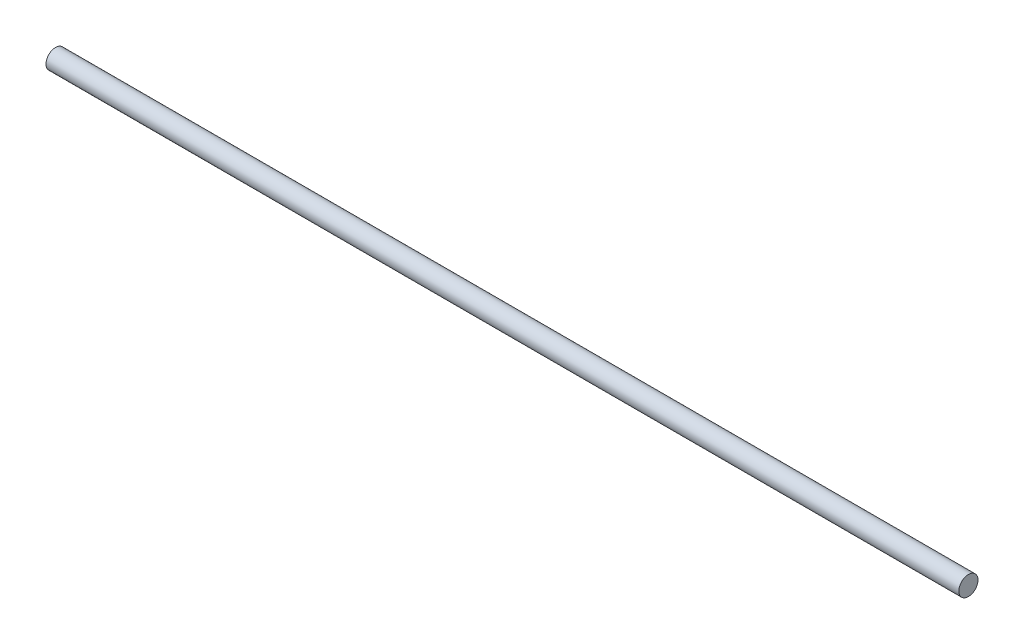
ISO-10303-21;
HEADER;
FILE_DESCRIPTION(('STEP AP214'),'2;1');
FILE_NAME('part.step','',(''),(''),'','','');
FILE_SCHEMA(('AUTOMOTIVE_DESIGN { 1 0 10303 214 1 1 1 1 }'));
ENDSEC;
DATA;
#1=APPLICATION_CONTEXT('core data for automotive mechanical design processes');
#2=APPLICATION_PROTOCOL_DEFINITION('international standard','automotive_design',2000,#1);
#3=PRODUCT_CONTEXT('',#1,'mechanical');
#4=PRODUCT('Part','Part','',(#3));
#5=PRODUCT_RELATED_PRODUCT_CATEGORY('part','',(#4));
#6=PRODUCT_DEFINITION_FORMATION('','',#4);
#7=PRODUCT_DEFINITION_CONTEXT('part definition',#1,'design');
#8=PRODUCT_DEFINITION('design','',#6,#7);
#9=PRODUCT_DEFINITION_SHAPE('','',#8);
#10=(LENGTH_UNIT() NAMED_UNIT(*) SI_UNIT(.MILLI.,.METRE.));
#11=(NAMED_UNIT(*) PLANE_ANGLE_UNIT() SI_UNIT($,.RADIAN.));
#12=(NAMED_UNIT(*) SI_UNIT($,.STERADIAN.) SOLID_ANGLE_UNIT());
#13=UNCERTAINTY_MEASURE_WITH_UNIT(LENGTH_MEASURE(1.E-05),#10,'distance_accuracy_value','');
#14=(GEOMETRIC_REPRESENTATION_CONTEXT(3) GLOBAL_UNCERTAINTY_ASSIGNED_CONTEXT((#13)) GLOBAL_UNIT_ASSIGNED_CONTEXT((#10,
#11,#12)) REPRESENTATION_CONTEXT('',''));
#15=CARTESIAN_POINT('',(0.,0.,0.));
#16=DIRECTION('',(0.,0.,1.));
#17=DIRECTION('',(1.,0.,0.));
#18=AXIS2_PLACEMENT_3D('',#15,#16,#17);
#19=CARTESIAN_POINT('',(75.565,0.,0.));
#20=DIRECTION('',(-1.,0.,0.));
#21=DIRECTION('',(0.,0.,1.));
#22=AXIS2_PLACEMENT_3D('',#19,#20,#21);
#23=CYLINDRICAL_SURFACE('',#22,1.5875);
#24=CARTESIAN_POINT('',(75.565,0.,0.));
#25=DIRECTION('',(1.,0.,0.));
#26=DIRECTION('',(0.,0.,-1.));
#27=AXIS2_PLACEMENT_3D('',#24,#25,#26);
#28=CIRCLE('',#27,1.5875);
#29=CARTESIAN_POINT('',(75.565,0.,-1.5875));
#30=VERTEX_POINT('',#29);
#31=EDGE_CURVE('E10',#30,#30,#28,.T.);
#32=ORIENTED_EDGE('',*,*,#31,.F.);
#33=EDGE_LOOP('',(#32));
#34=FACE_BOUND('',#33,.T.);
#35=CARTESIAN_POINT('',(-75.565,0.,0.));
#36=DIRECTION('',(1.,0.,0.));
#37=DIRECTION('',(0.,0.,-1.));
#38=AXIS2_PLACEMENT_3D('',#35,#36,#37);
#39=CIRCLE('',#38,1.5875);
#40=CARTESIAN_POINT('',(-75.565,0.,-1.5875));
#41=VERTEX_POINT('',#40);
#42=EDGE_CURVE('E40',#41,#41,#39,.T.);
#43=ORIENTED_EDGE('',*,*,#42,.T.);
#44=EDGE_LOOP('',(#43));
#45=FACE_BOUND('',#44,.T.);
#46=ADVANCED_FACE('F37',(#34,#45),#23,.T.);
#47=CARTESIAN_POINT('',(75.565,0.,0.));
#48=DIRECTION('',(1.,0.,0.));
#49=DIRECTION('',(0.,0.,-1.));
#50=AXIS2_PLACEMENT_3D('',#47,#48,#49);
#51=PLANE('',#50);
#52=ORIENTED_EDGE('',*,*,#31,.T.);
#53=EDGE_LOOP('',(#52));
#54=FACE_BOUND('',#53,.T.);
#55=ADVANCED_FACE('F54',(#54),#51,.T.);
#56=CARTESIAN_POINT('',(-75.565,0.,0.));
#57=DIRECTION('',(1.,0.,0.));
#58=DIRECTION('',(0.,0.,-1.));
#59=AXIS2_PLACEMENT_3D('',#56,#57,#58);
#60=PLANE('',#59);
#61=ORIENTED_EDGE('',*,*,#42,.F.);
#62=EDGE_LOOP('',(#61));
#63=FACE_BOUND('',#62,.T.);
#64=ADVANCED_FACE('F52',(#63),#60,.F.);
#65=CLOSED_SHELL('',(#46,#55,#64));
#66=MANIFOLD_SOLID_BREP('B2',#65);
#67=ADVANCED_BREP_SHAPE_REPRESENTATION('',(#18,#66),#14);
#68=SHAPE_DEFINITION_REPRESENTATION(#9,#67);
ENDSEC;
END-ISO-10303-21;
